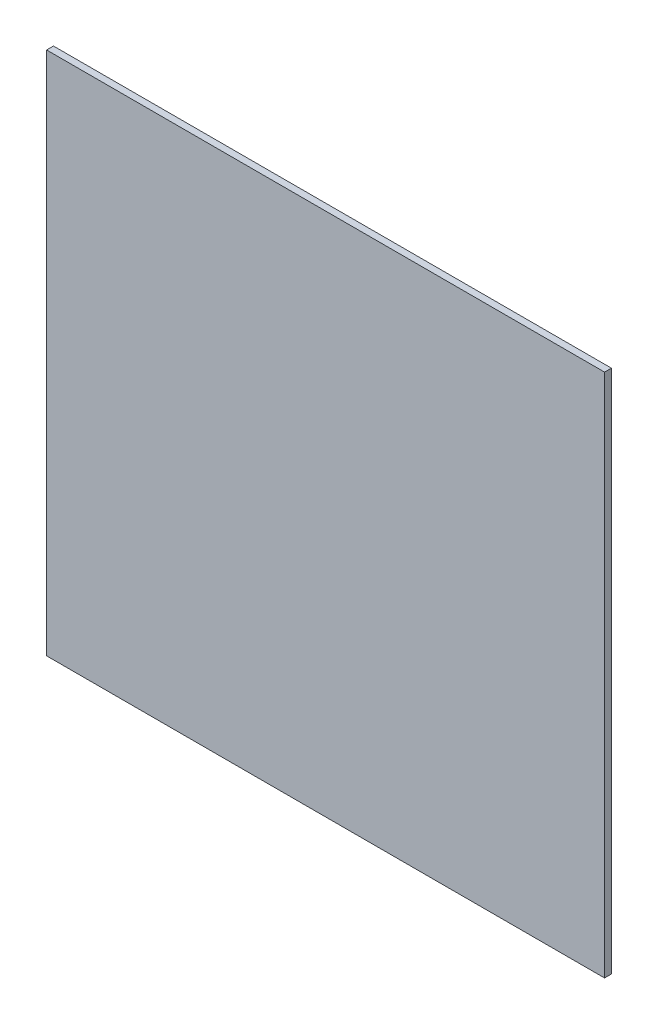
ISO-10303-21;
HEADER;
FILE_DESCRIPTION(('STEP AP214'),'2;1');
FILE_NAME('part.step','',(''),(''),'','','');
FILE_SCHEMA(('AUTOMOTIVE_DESIGN { 1 0 10303 214 1 1 1 1 }'));
ENDSEC;
DATA;
#1=APPLICATION_CONTEXT('core data for automotive mechanical design processes');
#2=APPLICATION_PROTOCOL_DEFINITION('international standard','automotive_design',2000,#1);
#3=PRODUCT_CONTEXT('',#1,'mechanical');
#4=PRODUCT('Part','Part','',(#3));
#5=PRODUCT_RELATED_PRODUCT_CATEGORY('part','',(#4));
#6=PRODUCT_DEFINITION_FORMATION('','',#4);
#7=PRODUCT_DEFINITION_CONTEXT('part definition',#1,'design');
#8=PRODUCT_DEFINITION('design','',#6,#7);
#9=PRODUCT_DEFINITION_SHAPE('','',#8);
#10=(LENGTH_UNIT() NAMED_UNIT(*) SI_UNIT(.MILLI.,.METRE.));
#11=(NAMED_UNIT(*) PLANE_ANGLE_UNIT() SI_UNIT($,.RADIAN.));
#12=(NAMED_UNIT(*) SI_UNIT($,.STERADIAN.) SOLID_ANGLE_UNIT());
#13=UNCERTAINTY_MEASURE_WITH_UNIT(LENGTH_MEASURE(1.E-05),#10,'distance_accuracy_value','');
#14=(GEOMETRIC_REPRESENTATION_CONTEXT(3) GLOBAL_UNCERTAINTY_ASSIGNED_CONTEXT((#13)) GLOBAL_UNIT_ASSIGNED_CONTEXT((#10,
#11,#12)) REPRESENTATION_CONTEXT('',''));
#15=CARTESIAN_POINT('',(0.,0.,0.));
#16=DIRECTION('',(0.,0.,1.));
#17=DIRECTION('',(1.,0.,0.));
#18=AXIS2_PLACEMENT_3D('',#15,#16,#17);
#19=CARTESIAN_POINT('',(0.,0.,11.938));
#20=DIRECTION('',(0.,1.,0.));
#21=DIRECTION('',(0.,0.,1.));
#22=AXIS2_PLACEMENT_3D('',#19,#20,#21);
#23=PLANE('',#22);
#24=DIRECTION('',(1.,0.,0.));
#25=VECTOR('',#24,1.);
#26=CARTESIAN_POINT('',(0.,0.,0.));
#27=LINE('',#26,#25);
#28=CARTESIAN_POINT('',(0.,0.,0.));
#29=VERTEX_POINT('',#28);
#30=CARTESIAN_POINT('',(972.312,0.,0.));
#31=VERTEX_POINT('',#30);
#32=EDGE_CURVE('E95',#29,#31,#27,.T.);
#33=ORIENTED_EDGE('',*,*,#32,.T.);
#34=DIRECTION('',(0.,0.,-1.));
#35=VECTOR('',#34,1.);
#36=CARTESIAN_POINT('',(972.312,0.,11.938));
#37=LINE('',#36,#35);
#38=CARTESIAN_POINT('',(972.312,0.,11.938));
#39=VERTEX_POINT('',#38);
#40=EDGE_CURVE('E11',#39,#31,#37,.T.);
#41=ORIENTED_EDGE('',*,*,#40,.F.);
#42=DIRECTION('',(1.,0.,0.));
#43=VECTOR('',#42,1.);
#44=CARTESIAN_POINT('',(0.,0.,11.938));
#45=LINE('',#44,#43);
#46=CARTESIAN_POINT('',(0.,0.,11.938));
#47=VERTEX_POINT('',#46);
#48=EDGE_CURVE('E83',#47,#39,#45,.T.);
#49=ORIENTED_EDGE('',*,*,#48,.F.);
#50=DIRECTION('',(0.,0.,-1.));
#51=VECTOR('',#50,1.);
#52=CARTESIAN_POINT('',(0.,0.,11.938));
#53=LINE('',#52,#51);
#54=EDGE_CURVE('E91',#47,#29,#53,.T.);
#55=ORIENTED_EDGE('',*,*,#54,.T.);
#56=EDGE_LOOP('',(#33,#41,#49,#55));
#57=FACE_BOUND('',#56,.T.);
#58=ADVANCED_FACE('F32',(#57),#23,.F.);
#59=CARTESIAN_POINT('',(972.312,0.,11.938));
#60=DIRECTION('',(-1.,0.,0.));
#61=DIRECTION('',(0.,0.,1.));
#62=AXIS2_PLACEMENT_3D('',#59,#60,#61);
#63=PLANE('',#62);
#64=DIRECTION('',(0.,1.,0.));
#65=VECTOR('',#64,1.);
#66=CARTESIAN_POINT('',(972.312,0.,0.));
#67=LINE('',#66,#65);
#68=CARTESIAN_POINT('',(972.312,914.4,0.));
#69=VERTEX_POINT('',#68);
#70=EDGE_CURVE('E87',#31,#69,#67,.T.);
#71=ORIENTED_EDGE('',*,*,#70,.T.);
#72=DIRECTION('',(0.,0.,-1.));
#73=VECTOR('',#72,1.);
#74=CARTESIAN_POINT('',(972.312,914.4,11.938));
#75=LINE('',#74,#73);
#76=CARTESIAN_POINT('',(972.312,914.4,11.938));
#77=VERTEX_POINT('',#76);
#78=EDGE_CURVE('E40',#77,#69,#75,.T.);
#79=ORIENTED_EDGE('',*,*,#78,.F.);
#80=DIRECTION('',(0.,1.,0.));
#81=VECTOR('',#80,1.);
#82=CARTESIAN_POINT('',(972.312,0.,11.938));
#83=LINE('',#82,#81);
#84=EDGE_CURVE('E78',#39,#77,#83,.T.);
#85=ORIENTED_EDGE('',*,*,#84,.F.);
#86=ORIENTED_EDGE('',*,*,#40,.T.);
#87=EDGE_LOOP('',(#71,#79,#85,#86));
#88=FACE_BOUND('',#87,.T.);
#89=ADVANCED_FACE('F86',(#88),#63,.F.);
#90=CARTESIAN_POINT('',(972.312,914.4,11.938));
#91=DIRECTION('',(0.,-1.,0.));
#92=DIRECTION('',(0.,0.,-1.));
#93=AXIS2_PLACEMENT_3D('',#90,#91,#92);
#94=PLANE('',#93);
#95=DIRECTION('',(-1.,0.,0.));
#96=VECTOR('',#95,1.);
#97=CARTESIAN_POINT('',(972.312,914.4,0.));
#98=LINE('',#97,#96);
#99=CARTESIAN_POINT('',(0.,914.4,0.));
#100=VERTEX_POINT('',#99);
#101=EDGE_CURVE('E65',#69,#100,#98,.T.);
#102=ORIENTED_EDGE('',*,*,#101,.T.);
#103=DIRECTION('',(0.,0.,-1.));
#104=VECTOR('',#103,1.);
#105=CARTESIAN_POINT('',(0.,914.4,11.938));
#106=LINE('',#105,#104);
#107=CARTESIAN_POINT('',(0.,914.4,11.938));
#108=VERTEX_POINT('',#107);
#109=EDGE_CURVE('E88',#108,#100,#106,.T.);
#110=ORIENTED_EDGE('',*,*,#109,.F.);
#111=DIRECTION('',(-1.,0.,0.));
#112=VECTOR('',#111,1.);
#113=CARTESIAN_POINT('',(972.312,914.4,11.938));
#114=LINE('',#113,#112);
#115=EDGE_CURVE('E81',#77,#108,#114,.T.);
#116=ORIENTED_EDGE('',*,*,#115,.F.);
#117=ORIENTED_EDGE('',*,*,#78,.T.);
#118=EDGE_LOOP('',(#102,#110,#116,#117));
#119=FACE_BOUND('',#118,.T.);
#120=ADVANCED_FACE('F89',(#119),#94,.F.);
#121=CARTESIAN_POINT('',(0.,0.,11.938));
#122=DIRECTION('',(1.,0.,0.));
#123=DIRECTION('',(0.,0.,-1.));
#124=AXIS2_PLACEMENT_3D('',#121,#122,#123);
#125=PLANE('',#124);
#126=DIRECTION('',(0.,-1.,0.));
#127=VECTOR('',#126,1.);
#128=CARTESIAN_POINT('',(0.,0.,0.));
#129=LINE('',#128,#127);
#130=EDGE_CURVE('E71',#100,#29,#129,.T.);
#131=ORIENTED_EDGE('',*,*,#130,.T.);
#132=ORIENTED_EDGE('',*,*,#54,.F.);
#133=DIRECTION('',(0.,-1.,0.));
#134=VECTOR('',#133,1.);
#135=CARTESIAN_POINT('',(0.,0.,11.938));
#136=LINE('',#135,#134);
#137=EDGE_CURVE('E48',#108,#47,#136,.T.);
#138=ORIENTED_EDGE('',*,*,#137,.F.);
#139=ORIENTED_EDGE('',*,*,#109,.T.);
#140=EDGE_LOOP('',(#131,#132,#138,#139));
#141=FACE_BOUND('',#140,.T.);
#142=ADVANCED_FACE('F102',(#141),#125,.F.);
#143=CARTESIAN_POINT('',(0.,0.,11.938));
#144=DIRECTION('',(0.,0.,1.));
#145=DIRECTION('',(1.,0.,0.));
#146=AXIS2_PLACEMENT_3D('',#143,#144,#145);
#147=PLANE('',#146);
#148=ORIENTED_EDGE('',*,*,#48,.T.);
#149=ORIENTED_EDGE('',*,*,#84,.T.);
#150=ORIENTED_EDGE('',*,*,#115,.T.);
#151=ORIENTED_EDGE('',*,*,#137,.T.);
#152=EDGE_LOOP('',(#148,#149,#150,#151));
#153=FACE_BOUND('',#152,.T.);
#154=ADVANCED_FACE('F79',(#153),#147,.T.);
#155=CARTESIAN_POINT('',(0.,0.,0.));
#156=DIRECTION('',(0.,0.,1.));
#157=DIRECTION('',(1.,0.,0.));
#158=AXIS2_PLACEMENT_3D('',#155,#156,#157);
#159=PLANE('',#158);
#160=ORIENTED_EDGE('',*,*,#32,.F.);
#161=ORIENTED_EDGE('',*,*,#130,.F.);
#162=ORIENTED_EDGE('',*,*,#101,.F.);
#163=ORIENTED_EDGE('',*,*,#70,.F.);
#164=EDGE_LOOP('',(#160,#161,#162,#163));
#165=FACE_BOUND('',#164,.T.);
#166=ADVANCED_FACE('F105',(#165),#159,.F.);
#167=CLOSED_SHELL('',(#58,#89,#120,#142,#154,#166));
#168=MANIFOLD_SOLID_BREP('B2',#167);
#169=ADVANCED_BREP_SHAPE_REPRESENTATION('',(#18,#168),#14);
#170=SHAPE_DEFINITION_REPRESENTATION(#9,#169);
ENDSEC;
END-ISO-10303-21;
